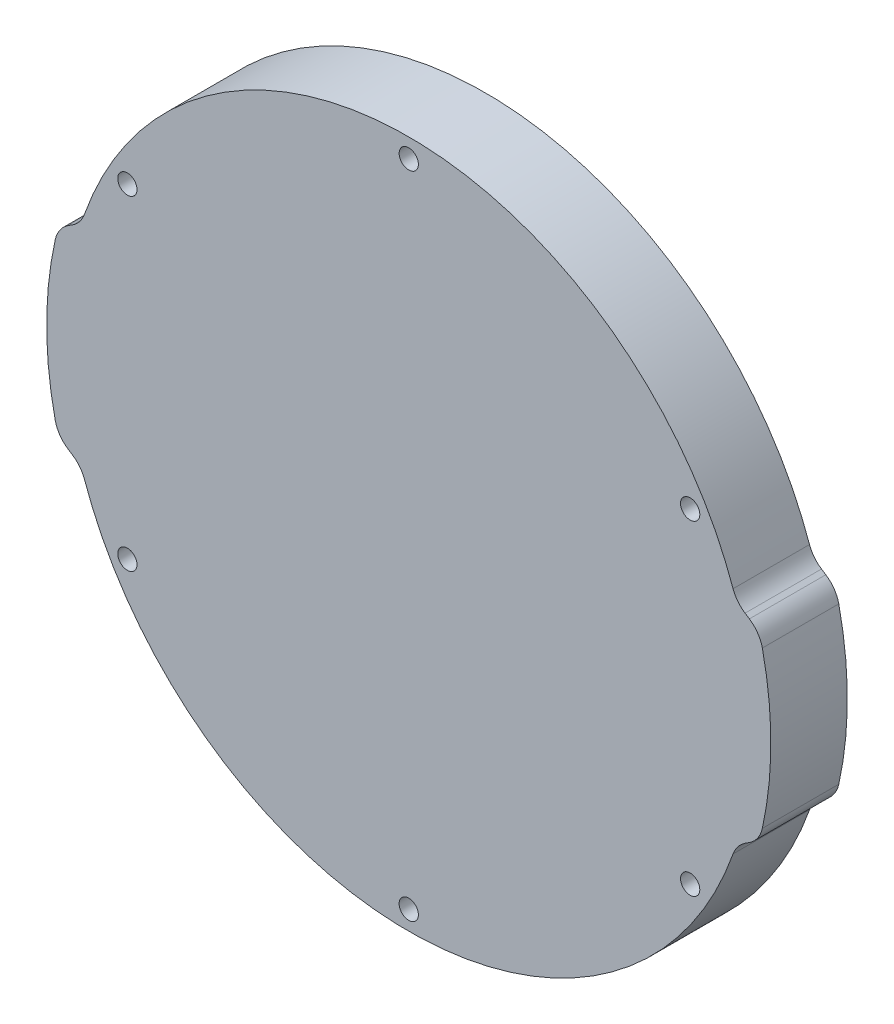
ISO-10303-21;
HEADER;
FILE_DESCRIPTION(('STEP AP214'),'2;1');
FILE_NAME('part.step','',(''),(''),'','','');
FILE_SCHEMA(('AUTOMOTIVE_DESIGN { 1 0 10303 214 1 1 1 1 }'));
ENDSEC;
DATA;
#1=APPLICATION_CONTEXT('core data for automotive mechanical design processes');
#2=APPLICATION_PROTOCOL_DEFINITION('international standard','automotive_design',2000,#1);
#3=PRODUCT_CONTEXT('',#1,'mechanical');
#4=PRODUCT('Part','Part','',(#3));
#5=PRODUCT_RELATED_PRODUCT_CATEGORY('part','',(#4));
#6=PRODUCT_DEFINITION_FORMATION('','',#4);
#7=PRODUCT_DEFINITION_CONTEXT('part definition',#1,'design');
#8=PRODUCT_DEFINITION('design','',#6,#7);
#9=PRODUCT_DEFINITION_SHAPE('','',#8);
#10=(LENGTH_UNIT() NAMED_UNIT(*) SI_UNIT(.MILLI.,.METRE.));
#11=(NAMED_UNIT(*) PLANE_ANGLE_UNIT() SI_UNIT($,.RADIAN.));
#12=(NAMED_UNIT(*) SI_UNIT($,.STERADIAN.) SOLID_ANGLE_UNIT());
#13=UNCERTAINTY_MEASURE_WITH_UNIT(LENGTH_MEASURE(1.E-05),#10,'distance_accuracy_value','');
#14=(GEOMETRIC_REPRESENTATION_CONTEXT(3) GLOBAL_UNCERTAINTY_ASSIGNED_CONTEXT((#13)) GLOBAL_UNIT_ASSIGNED_CONTEXT((#10,
#11,#12)) REPRESENTATION_CONTEXT('',''));
#15=CARTESIAN_POINT('',(0.,0.,0.));
#16=DIRECTION('',(0.,0.,1.));
#17=DIRECTION('',(1.,0.,0.));
#18=AXIS2_PLACEMENT_3D('',#15,#16,#17);
#19=CARTESIAN_POINT('',(0.,0.,12.7));
#20=DIRECTION('',(0.,0.,-1.));
#21=DIRECTION('',(-1.,0.,0.));
#22=AXIS2_PLACEMENT_3D('',#19,#20,#21);
#23=PLANE('',#22);
#24=CARTESIAN_POINT('',(5.42327943909187E-12,-53.975,12.7));
#25=DIRECTION('',(0.,0.,1.));
#26=DIRECTION('',(1.,0.,0.));
#27=AXIS2_PLACEMENT_3D('',#24,#25,#26);
#28=CIRCLE('',#27,1.6);
#29=CARTESIAN_POINT('',(1.60000000000542,-53.975,12.7));
#30=VERTEX_POINT('',#29);
#31=EDGE_CURVE('E509',#30,#30,#28,.T.);
#32=ORIENTED_EDGE('',*,*,#31,.F.);
#33=EDGE_LOOP('',(#32));
#34=FACE_BOUND('',#33,.T.);
#35=CARTESIAN_POINT('',(46.7437211692664,26.9875000000024,12.7));
#36=DIRECTION('',(0.,0.,1.));
#37=DIRECTION('',(1.,0.,0.));
#38=AXIS2_PLACEMENT_3D('',#35,#36,#37);
#39=CIRCLE('',#38,1.60000000000001);
#40=CARTESIAN_POINT('',(48.3437211692664,26.9875000000024,12.7));
#41=VERTEX_POINT('',#40);
#42=EDGE_CURVE('E318',#41,#41,#39,.T.);
#43=ORIENTED_EDGE('',*,*,#42,.F.);
#44=EDGE_LOOP('',(#43));
#45=FACE_BOUND('',#44,.T.);
#46=CARTESIAN_POINT('',(0.,53.975,12.7));
#47=DIRECTION('',(0.,0.,1.));
#48=DIRECTION('',(1.,0.,0.));
#49=AXIS2_PLACEMENT_3D('',#46,#47,#48);
#50=CIRCLE('',#49,1.6);
#51=CARTESIAN_POINT('',(1.6,53.975,12.7));
#52=VERTEX_POINT('',#51);
#53=EDGE_CURVE('E327',#52,#52,#50,.T.);
#54=ORIENTED_EDGE('',*,*,#53,.F.);
#55=EDGE_LOOP('',(#54));
#56=FACE_BOUND('',#55,.T.);
#57=CARTESIAN_POINT('',(0.,0.,12.7));
#58=DIRECTION('',(0.,0.,1.));
#59=DIRECTION('',(-1.,0.,0.));
#60=AXIS2_PLACEMENT_3D('',#57,#58,#59);
#61=CIRCLE('',#60,60.15);
#62=CARTESIAN_POINT('',(58.7341357738568,-12.97396604351,12.7));
#63=VERTEX_POINT('',#62);
#64=CARTESIAN_POINT('',(58.7341357738568,12.97396604351,12.7));
#65=VERTEX_POINT('',#64);
#66=EDGE_CURVE('E219',#63,#65,#61,.T.);
#67=ORIENTED_EDGE('',*,*,#66,.T.);
#68=CARTESIAN_POINT('',(53.8518302232453,11.8954983757203,12.7));
#69=DIRECTION('',(0.,0.,-1.));
#70=DIRECTION('',(-1.,0.,0.));
#71=AXIS2_PLACEMENT_3D('',#68,#69,#70);
#72=CIRCLE('',#71,5.);
#73=CARTESIAN_POINT('',(56.5773734681787,16.0873254260645,12.7));
#74=VERTEX_POINT('',#73);
#75=EDGE_CURVE('E256',#65,#74,#72,.F.);
#76=ORIENTED_EDGE('',*,*,#75,.T.);
#77=DIRECTION('',(-0.838365410068851,0.545108648986684,0.));
#78=VECTOR('',#77,1.);
#79=CARTESIAN_POINT('',(58.2496566513486,15.,12.7));
#80=LINE('',#79,#78);
#81=CARTESIAN_POINT('',(55.8597455361239,16.5539300686456,12.7));
#82=VERTEX_POINT('',#81);
#83=EDGE_CURVE('E354',#74,#82,#80,.T.);
#84=ORIENTED_EDGE('',*,*,#83,.T.);
#85=CARTESIAN_POINT('',(58.5852887810573,20.7457571189899,12.7));
#86=DIRECTION('',(0.,0.,-1.));
#87=DIRECTION('',(-1.,0.,0.));
#88=AXIS2_PLACEMENT_3D('',#85,#86,#87);
#89=CIRCLE('',#88,5.);
#90=CARTESIAN_POINT('',(53.87207166271,19.0767501102216,12.7));
#91=VERTEX_POINT('',#90);
#92=EDGE_CURVE('E171',#82,#91,#89,.T.);
#93=ORIENTED_EDGE('',*,*,#92,.T.);
#94=CARTESIAN_POINT('',(0.,0.,12.7));
#95=DIRECTION('',(0.,0.,1.));
#96=DIRECTION('',(1.,0.,0.));
#97=AXIS2_PLACEMENT_3D('',#94,#95,#96);
#98=CIRCLE('',#97,57.15);
#99=CARTESIAN_POINT('',(-53.87207166271,19.0767501102216,12.7));
#100=VERTEX_POINT('',#99);
#101=EDGE_CURVE('E181',#91,#100,#98,.T.);
#102=ORIENTED_EDGE('',*,*,#101,.T.);
#103=CARTESIAN_POINT('',(-58.5852887810573,20.7457571189899,12.7));
#104=DIRECTION('',(0.,0.,-1.));
#105=DIRECTION('',(-1.,0.,0.));
#106=AXIS2_PLACEMENT_3D('',#103,#104,#105);
#107=CIRCLE('',#106,5.);
#108=CARTESIAN_POINT('',(-55.8597455361239,16.5539300686456,12.7));
#109=VERTEX_POINT('',#108);
#110=EDGE_CURVE('E11',#100,#109,#107,.T.);
#111=ORIENTED_EDGE('',*,*,#110,.T.);
#112=DIRECTION('',(-0.838365410068851,-0.545108648986684,0.));
#113=VECTOR('',#112,1.);
#114=CARTESIAN_POINT('',(-58.2496566513486,15.,12.7));
#115=LINE('',#114,#113);
#116=CARTESIAN_POINT('',(-56.5773734681787,16.0873254260645,12.7));
#117=VERTEX_POINT('',#116);
#118=EDGE_CURVE('E308',#109,#117,#115,.T.);
#119=ORIENTED_EDGE('',*,*,#118,.T.);
#120=CARTESIAN_POINT('',(-53.8518302232453,11.8954983757203,12.7));
#121=DIRECTION('',(0.,0.,-1.));
#122=DIRECTION('',(-1.,0.,0.));
#123=AXIS2_PLACEMENT_3D('',#120,#121,#122);
#124=CIRCLE('',#123,5.);
#125=CARTESIAN_POINT('',(-58.7341357738568,12.97396604351,12.7));
#126=VERTEX_POINT('',#125);
#127=EDGE_CURVE('E247',#117,#126,#124,.F.);
#128=ORIENTED_EDGE('',*,*,#127,.T.);
#129=CARTESIAN_POINT('',(0.,0.,12.7));
#130=DIRECTION('',(0.,0.,1.));
#131=DIRECTION('',(1.,0.,0.));
#132=AXIS2_PLACEMENT_3D('',#129,#130,#131);
#133=CIRCLE('',#132,60.15);
#134=CARTESIAN_POINT('',(-58.7341357738568,-12.97396604351,12.7));
#135=VERTEX_POINT('',#134);
#136=EDGE_CURVE('E312',#126,#135,#133,.T.);
#137=ORIENTED_EDGE('',*,*,#136,.T.);
#138=CARTESIAN_POINT('',(-53.8518302232453,-11.8954983757203,12.7));
#139=DIRECTION('',(0.,0.,-1.));
#140=DIRECTION('',(-1.,0.,0.));
#141=AXIS2_PLACEMENT_3D('',#138,#139,#140);
#142=CIRCLE('',#141,5.);
#143=CARTESIAN_POINT('',(-56.5773734681787,-16.0873254260645,12.7));
#144=VERTEX_POINT('',#143);
#145=EDGE_CURVE('E250',#135,#144,#142,.F.);
#146=ORIENTED_EDGE('',*,*,#145,.T.);
#147=DIRECTION('',(0.838365410068851,-0.545108648986684,0.));
#148=VECTOR('',#147,1.);
#149=CARTESIAN_POINT('',(-58.2496566513486,-15.,12.7));
#150=LINE('',#149,#148);
#151=CARTESIAN_POINT('',(-55.8597455361239,-16.5539300686456,12.7));
#152=VERTEX_POINT('',#151);
#153=EDGE_CURVE('E363',#144,#152,#150,.T.);
#154=ORIENTED_EDGE('',*,*,#153,.T.);
#155=CARTESIAN_POINT('',(-58.5852887810573,-20.7457571189899,12.7));
#156=DIRECTION('',(0.,0.,-1.));
#157=DIRECTION('',(-1.,0.,0.));
#158=AXIS2_PLACEMENT_3D('',#155,#156,#157);
#159=CIRCLE('',#158,5.);
#160=CARTESIAN_POINT('',(-53.87207166271,-19.0767501102216,12.7));
#161=VERTEX_POINT('',#160);
#162=EDGE_CURVE('E301',#152,#161,#159,.T.);
#163=ORIENTED_EDGE('',*,*,#162,.T.);
#164=CARTESIAN_POINT('',(0.,0.,12.7));
#165=DIRECTION('',(0.,0.,1.));
#166=DIRECTION('',(1.,0.,0.));
#167=AXIS2_PLACEMENT_3D('',#164,#165,#166);
#168=CIRCLE('',#167,57.15);
#169=CARTESIAN_POINT('',(53.87207166271,-19.0767501102216,12.7));
#170=VERTEX_POINT('',#169);
#171=EDGE_CURVE('E367',#161,#170,#168,.T.);
#172=ORIENTED_EDGE('',*,*,#171,.T.);
#173=CARTESIAN_POINT('',(58.5852887810573,-20.7457571189899,12.7));
#174=DIRECTION('',(0.,0.,-1.));
#175=DIRECTION('',(-1.,0.,0.));
#176=AXIS2_PLACEMENT_3D('',#173,#174,#175);
#177=CIRCLE('',#176,5.);
#178=CARTESIAN_POINT('',(55.8597455361239,-16.5539300686456,12.7));
#179=VERTEX_POINT('',#178);
#180=EDGE_CURVE('E68',#170,#179,#177,.T.);
#181=ORIENTED_EDGE('',*,*,#180,.T.);
#182=DIRECTION('',(0.838365410068851,0.545108648986684,0.));
#183=VECTOR('',#182,1.);
#184=CARTESIAN_POINT('',(58.2496566513486,-15.,12.7));
#185=LINE('',#184,#183);
#186=CARTESIAN_POINT('',(56.5773734681787,-16.0873254260645,12.7));
#187=VERTEX_POINT('',#186);
#188=EDGE_CURVE('E221',#179,#187,#185,.T.);
#189=ORIENTED_EDGE('',*,*,#188,.T.);
#190=CARTESIAN_POINT('',(53.8518302232453,-11.8954983757203,12.7));
#191=DIRECTION('',(0.,0.,-1.));
#192=DIRECTION('',(-1.,0.,0.));
#193=AXIS2_PLACEMENT_3D('',#190,#191,#192);
#194=CIRCLE('',#193,5.);
#195=EDGE_CURVE('E253',#187,#63,#194,.F.);
#196=ORIENTED_EDGE('',*,*,#195,.T.);
#197=EDGE_LOOP('',(#67,#76,#84,#93,#102,#111,#119,#128,#137,#146,#154,#163,#172,#181,#189,#196));
#198=FACE_BOUND('',#197,.T.);
#199=CARTESIAN_POINT('',(-46.743721169261,-26.9875000000024,12.7));
#200=DIRECTION('',(0.,0.,1.));
#201=DIRECTION('',(1.,0.,0.));
#202=AXIS2_PLACEMENT_3D('',#199,#200,#201);
#203=CIRCLE('',#202,1.6);
#204=CARTESIAN_POINT('',(-45.143721169261,-26.9875000000024,12.7));
#205=VERTEX_POINT('',#204);
#206=EDGE_CURVE('E317',#205,#205,#203,.T.);
#207=ORIENTED_EDGE('',*,*,#206,.F.);
#208=EDGE_LOOP('',(#207));
#209=FACE_BOUND('',#208,.T.);
#210=CARTESIAN_POINT('',(46.7437211692692,-26.9874999999976,12.7));
#211=DIRECTION('',(0.,0.,1.));
#212=DIRECTION('',(1.,0.,0.));
#213=AXIS2_PLACEMENT_3D('',#210,#211,#212);
#214=CIRCLE('',#213,1.6);
#215=CARTESIAN_POINT('',(48.3437211692691,-26.9874999999976,12.7));
#216=VERTEX_POINT('',#215);
#217=EDGE_CURVE('E332',#216,#216,#214,.T.);
#218=ORIENTED_EDGE('',*,*,#217,.F.);
#219=EDGE_LOOP('',(#218));
#220=FACE_BOUND('',#219,.T.);
#221=CARTESIAN_POINT('',(-46.7437211692637,26.9874999999976,12.7));
#222=DIRECTION('',(0.,0.,1.));
#223=DIRECTION('',(1.,0.,0.));
#224=AXIS2_PLACEMENT_3D('',#221,#222,#223);
#225=CIRCLE('',#224,1.6);
#226=CARTESIAN_POINT('',(-45.1437211692637,26.9874999999976,12.7));
#227=VERTEX_POINT('',#226);
#228=EDGE_CURVE('E502',#227,#227,#225,.T.);
#229=ORIENTED_EDGE('',*,*,#228,.F.);
#230=EDGE_LOOP('',(#229));
#231=FACE_BOUND('',#230,.T.);
#232=ADVANCED_FACE('F45',(#34,#45,#56,#198,#209,#220,#231),#23,.F.);
#233=CARTESIAN_POINT('',(0.,0.,0.));
#234=DIRECTION('',(0.,0.,-1.));
#235=DIRECTION('',(-1.,0.,0.));
#236=AXIS2_PLACEMENT_3D('',#233,#234,#235);
#237=PLANE('',#236);
#238=CARTESIAN_POINT('',(5.42327943909187E-12,-53.975,0.));
#239=DIRECTION('',(0.,0.,1.));
#240=DIRECTION('',(1.,0.,0.));
#241=AXIS2_PLACEMENT_3D('',#238,#239,#240);
#242=CIRCLE('',#241,1.6);
#243=CARTESIAN_POINT('',(1.60000000000542,-53.975,0.));
#244=VERTEX_POINT('',#243);
#245=EDGE_CURVE('E506',#244,#244,#242,.T.);
#246=ORIENTED_EDGE('',*,*,#245,.T.);
#247=EDGE_LOOP('',(#246));
#248=FACE_BOUND('',#247,.T.);
#249=CARTESIAN_POINT('',(46.7437211692664,26.9875000000024,0.));
#250=DIRECTION('',(0.,0.,1.));
#251=DIRECTION('',(1.,0.,0.));
#252=AXIS2_PLACEMENT_3D('',#249,#250,#251);
#253=CIRCLE('',#252,1.60000000000001);
#254=CARTESIAN_POINT('',(48.3437211692664,26.9875000000024,0.));
#255=VERTEX_POINT('',#254);
#256=EDGE_CURVE('E329',#255,#255,#253,.T.);
#257=ORIENTED_EDGE('',*,*,#256,.T.);
#258=EDGE_LOOP('',(#257));
#259=FACE_BOUND('',#258,.T.);
#260=CARTESIAN_POINT('',(0.,53.975,0.));
#261=DIRECTION('',(0.,0.,1.));
#262=DIRECTION('',(1.,0.,0.));
#263=AXIS2_PLACEMENT_3D('',#260,#261,#262);
#264=CIRCLE('',#263,1.6);
#265=CARTESIAN_POINT('',(1.6,53.975,0.));
#266=VERTEX_POINT('',#265);
#267=EDGE_CURVE('E323',#266,#266,#264,.T.);
#268=ORIENTED_EDGE('',*,*,#267,.T.);
#269=EDGE_LOOP('',(#268));
#270=FACE_BOUND('',#269,.T.);
#271=DIRECTION('',(-0.838365410068851,0.545108648986684,0.));
#272=VECTOR('',#271,1.);
#273=CARTESIAN_POINT('',(58.2496566513486,15.,0.));
#274=LINE('',#273,#272);
#275=CARTESIAN_POINT('',(56.5773734681787,16.0873254260645,0.));
#276=VERTEX_POINT('',#275);
#277=CARTESIAN_POINT('',(55.8597455361239,16.5539300686456,0.));
#278=VERTEX_POINT('',#277);
#279=EDGE_CURVE('E191',#276,#278,#274,.T.);
#280=ORIENTED_EDGE('',*,*,#279,.F.);
#281=CARTESIAN_POINT('',(53.8518302232453,11.8954983757203,0.));
#282=DIRECTION('',(0.,0.,-1.));
#283=DIRECTION('',(-1.,0.,0.));
#284=AXIS2_PLACEMENT_3D('',#281,#282,#283);
#285=CIRCLE('',#284,5.);
#286=CARTESIAN_POINT('',(58.7341357738568,12.97396604351,0.));
#287=VERTEX_POINT('',#286);
#288=EDGE_CURVE('E237',#276,#287,#285,.T.);
#289=ORIENTED_EDGE('',*,*,#288,.T.);
#290=CARTESIAN_POINT('',(0.,0.,0.));
#291=DIRECTION('',(0.,0.,1.));
#292=DIRECTION('',(-1.,0.,0.));
#293=AXIS2_PLACEMENT_3D('',#290,#291,#292);
#294=CIRCLE('',#293,60.15);
#295=CARTESIAN_POINT('',(58.7341357738568,-12.97396604351,0.));
#296=VERTEX_POINT('',#295);
#297=EDGE_CURVE('E201',#296,#287,#294,.T.);
#298=ORIENTED_EDGE('',*,*,#297,.F.);
#299=CARTESIAN_POINT('',(53.8518302232453,-11.8954983757203,0.));
#300=DIRECTION('',(0.,0.,-1.));
#301=DIRECTION('',(-1.,0.,0.));
#302=AXIS2_PLACEMENT_3D('',#299,#300,#301);
#303=CIRCLE('',#302,5.);
#304=CARTESIAN_POINT('',(56.5773734681787,-16.0873254260645,0.));
#305=VERTEX_POINT('',#304);
#306=EDGE_CURVE('E234',#296,#305,#303,.T.);
#307=ORIENTED_EDGE('',*,*,#306,.T.);
#308=DIRECTION('',(0.838365410068851,0.545108648986684,0.));
#309=VECTOR('',#308,1.);
#310=CARTESIAN_POINT('',(58.2496566513486,-15.,0.));
#311=LINE('',#310,#309);
#312=CARTESIAN_POINT('',(55.8597455361239,-16.5539300686456,0.));
#313=VERTEX_POINT('',#312);
#314=EDGE_CURVE('E216',#313,#305,#311,.T.);
#315=ORIENTED_EDGE('',*,*,#314,.F.);
#316=CARTESIAN_POINT('',(58.5852887810573,-20.7457571189899,0.));
#317=DIRECTION('',(0.,0.,-1.));
#318=DIRECTION('',(-1.,0.,0.));
#319=AXIS2_PLACEMENT_3D('',#316,#317,#318);
#320=CIRCLE('',#319,5.);
#321=CARTESIAN_POINT('',(53.87207166271,-19.0767501102216,0.));
#322=VERTEX_POINT('',#321);
#323=EDGE_CURVE('E293',#313,#322,#320,.F.);
#324=ORIENTED_EDGE('',*,*,#323,.T.);
#325=CARTESIAN_POINT('',(0.,0.,0.));
#326=DIRECTION('',(0.,0.,1.));
#327=DIRECTION('',(1.,0.,0.));
#328=AXIS2_PLACEMENT_3D('',#325,#326,#327);
#329=CIRCLE('',#328,57.15);
#330=CARTESIAN_POINT('',(-53.87207166271,-19.0767501102216,0.));
#331=VERTEX_POINT('',#330);
#332=EDGE_CURVE('E212',#331,#322,#329,.T.);
#333=ORIENTED_EDGE('',*,*,#332,.F.);
#334=CARTESIAN_POINT('',(-58.5852887810573,-20.7457571189899,0.));
#335=DIRECTION('',(0.,0.,-1.));
#336=DIRECTION('',(-1.,0.,0.));
#337=AXIS2_PLACEMENT_3D('',#334,#335,#336);
#338=CIRCLE('',#337,5.);
#339=CARTESIAN_POINT('',(-55.8597455361239,-16.5539300686456,0.));
#340=VERTEX_POINT('',#339);
#341=EDGE_CURVE('E298',#331,#340,#338,.F.);
#342=ORIENTED_EDGE('',*,*,#341,.T.);
#343=DIRECTION('',(0.838365410068851,-0.545108648986684,0.));
#344=VECTOR('',#343,1.);
#345=CARTESIAN_POINT('',(-58.2496566513486,-15.,0.));
#346=LINE('',#345,#344);
#347=CARTESIAN_POINT('',(-56.5773734681787,-16.0873254260645,0.));
#348=VERTEX_POINT('',#347);
#349=EDGE_CURVE('E208',#348,#340,#346,.T.);
#350=ORIENTED_EDGE('',*,*,#349,.F.);
#351=CARTESIAN_POINT('',(-53.8518302232453,-11.8954983757203,0.));
#352=DIRECTION('',(0.,0.,-1.));
#353=DIRECTION('',(-1.,0.,0.));
#354=AXIS2_PLACEMENT_3D('',#351,#352,#353);
#355=CIRCLE('',#354,5.);
#356=CARTESIAN_POINT('',(-58.7341357738568,-12.97396604351,0.));
#357=VERTEX_POINT('',#356);
#358=EDGE_CURVE('E231',#348,#357,#355,.T.);
#359=ORIENTED_EDGE('',*,*,#358,.T.);
#360=CARTESIAN_POINT('',(0.,0.,0.));
#361=DIRECTION('',(0.,0.,1.));
#362=DIRECTION('',(1.,0.,0.));
#363=AXIS2_PLACEMENT_3D('',#360,#361,#362);
#364=CIRCLE('',#363,60.15);
#365=CARTESIAN_POINT('',(-58.7341357738568,12.97396604351,0.));
#366=VERTEX_POINT('',#365);
#367=EDGE_CURVE('E198',#366,#357,#364,.T.);
#368=ORIENTED_EDGE('',*,*,#367,.F.);
#369=CARTESIAN_POINT('',(-53.8518302232453,11.8954983757203,0.));
#370=DIRECTION('',(0.,0.,-1.));
#371=DIRECTION('',(-1.,0.,0.));
#372=AXIS2_PLACEMENT_3D('',#369,#370,#371);
#373=CIRCLE('',#372,5.);
#374=CARTESIAN_POINT('',(-56.5773734681787,16.0873254260645,0.));
#375=VERTEX_POINT('',#374);
#376=EDGE_CURVE('E228',#366,#375,#373,.T.);
#377=ORIENTED_EDGE('',*,*,#376,.T.);
#378=DIRECTION('',(-0.838365410068851,-0.545108648986684,0.));
#379=VECTOR('',#378,1.);
#380=CARTESIAN_POINT('',(-58.2496566513486,15.,0.));
#381=LINE('',#380,#379);
#382=CARTESIAN_POINT('',(-55.8597455361239,16.5539300686456,0.));
#383=VERTEX_POINT('',#382);
#384=EDGE_CURVE('E190',#383,#375,#381,.T.);
#385=ORIENTED_EDGE('',*,*,#384,.F.);
#386=CARTESIAN_POINT('',(-58.5852887810573,20.7457571189899,0.));
#387=DIRECTION('',(0.,0.,-1.));
#388=DIRECTION('',(-1.,0.,0.));
#389=AXIS2_PLACEMENT_3D('',#386,#387,#388);
#390=CIRCLE('',#389,5.);
#391=CARTESIAN_POINT('',(-53.87207166271,19.0767501102216,0.));
#392=VERTEX_POINT('',#391);
#393=EDGE_CURVE('E54',#383,#392,#390,.F.);
#394=ORIENTED_EDGE('',*,*,#393,.T.);
#395=CARTESIAN_POINT('',(0.,0.,0.));
#396=DIRECTION('',(0.,0.,1.));
#397=DIRECTION('',(1.,0.,0.));
#398=AXIS2_PLACEMENT_3D('',#395,#396,#397);
#399=CIRCLE('',#398,57.15);
#400=CARTESIAN_POINT('',(53.87207166271,19.0767501102216,0.));
#401=VERTEX_POINT('',#400);
#402=EDGE_CURVE('E178',#401,#392,#399,.T.);
#403=ORIENTED_EDGE('',*,*,#402,.F.);
#404=CARTESIAN_POINT('',(58.5852887810573,20.7457571189899,0.));
#405=DIRECTION('',(0.,0.,-1.));
#406=DIRECTION('',(-1.,0.,0.));
#407=AXIS2_PLACEMENT_3D('',#404,#405,#406);
#408=CIRCLE('',#407,5.);
#409=EDGE_CURVE('E160',#401,#278,#408,.F.);
#410=ORIENTED_EDGE('',*,*,#409,.T.);
#411=EDGE_LOOP('',(#280,#289,#298,#307,#315,#324,#333,#342,#350,#359,#368,#377,#385,#394,#403,#410));
#412=FACE_BOUND('',#411,.T.);
#413=CARTESIAN_POINT('',(-46.743721169261,-26.9875000000024,0.));
#414=DIRECTION('',(0.,0.,1.));
#415=DIRECTION('',(1.,0.,0.));
#416=AXIS2_PLACEMENT_3D('',#413,#414,#415);
#417=CIRCLE('',#416,1.6);
#418=CARTESIAN_POINT('',(-45.143721169261,-26.9875000000024,0.));
#419=VERTEX_POINT('',#418);
#420=EDGE_CURVE('E314',#419,#419,#417,.T.);
#421=ORIENTED_EDGE('',*,*,#420,.T.);
#422=EDGE_LOOP('',(#421));
#423=FACE_BOUND('',#422,.T.);
#424=CARTESIAN_POINT('',(46.7437211692692,-26.9874999999976,0.));
#425=DIRECTION('',(0.,0.,1.));
#426=DIRECTION('',(1.,0.,0.));
#427=AXIS2_PLACEMENT_3D('',#424,#425,#426);
#428=CIRCLE('',#427,1.6);
#429=CARTESIAN_POINT('',(48.3437211692691,-26.9874999999976,0.));
#430=VERTEX_POINT('',#429);
#431=EDGE_CURVE('E341',#430,#430,#428,.T.);
#432=ORIENTED_EDGE('',*,*,#431,.T.);
#433=EDGE_LOOP('',(#432));
#434=FACE_BOUND('',#433,.T.);
#435=CARTESIAN_POINT('',(-46.7437211692637,26.9874999999976,0.));
#436=DIRECTION('',(0.,0.,1.));
#437=DIRECTION('',(1.,0.,0.));
#438=AXIS2_PLACEMENT_3D('',#435,#436,#437);
#439=CIRCLE('',#438,1.6);
#440=CARTESIAN_POINT('',(-45.1437211692637,26.9874999999976,0.));
#441=VERTEX_POINT('',#440);
#442=EDGE_CURVE('E500',#441,#441,#439,.T.);
#443=ORIENTED_EDGE('',*,*,#442,.T.);
#444=EDGE_LOOP('',(#443));
#445=FACE_BOUND('',#444,.T.);
#446=ADVANCED_FACE('F186',(#248,#259,#270,#412,#423,#434,#445),#237,.T.);
#447=CARTESIAN_POINT('',(0.,0.,12.7));
#448=DIRECTION('',(0.,0.,-1.));
#449=DIRECTION('',(-1.,0.,0.));
#450=AXIS2_PLACEMENT_3D('',#447,#448,#449);
#451=CYLINDRICAL_SURFACE('',#450,60.15);
#452=ORIENTED_EDGE('',*,*,#297,.T.);
#453=DIRECTION('',(0.,0.,-1.));
#454=VECTOR('',#453,1.);
#455=CARTESIAN_POINT('',(58.7341357738569,12.97396604351,12.7));
#456=LINE('',#455,#454);
#457=EDGE_CURVE('E244',#287,#65,#456,.F.);
#458=ORIENTED_EDGE('',*,*,#457,.T.);
#459=ORIENTED_EDGE('',*,*,#66,.F.);
#460=DIRECTION('',(0.,0.,-1.));
#461=VECTOR('',#460,1.);
#462=CARTESIAN_POINT('',(58.7341357738569,-12.97396604351,12.7));
#463=LINE('',#462,#461);
#464=EDGE_CURVE('E240',#63,#296,#463,.T.);
#465=ORIENTED_EDGE('',*,*,#464,.T.);
#466=EDGE_LOOP('',(#452,#458,#459,#465));
#467=FACE_BOUND('',#466,.T.);
#468=ADVANCED_FACE('F377',(#467),#451,.T.);
#469=CARTESIAN_POINT('',(58.2496566513486,15.,12.7));
#470=DIRECTION('',(-0.545108648986684,-0.838365410068851,0.));
#471=DIRECTION('',(0.838365410068851,-0.545108648986684,0.));
#472=AXIS2_PLACEMENT_3D('',#469,#470,#471);
#473=PLANE('',#472);
#474=ORIENTED_EDGE('',*,*,#279,.T.);
#475=DIRECTION('',(0.,0.,1.));
#476=VECTOR('',#475,1.);
#477=CARTESIAN_POINT('',(55.8597455361239,16.5539300686456,12.7));
#478=LINE('',#477,#476);
#479=EDGE_CURVE('E165',#278,#82,#478,.T.);
#480=ORIENTED_EDGE('',*,*,#479,.T.);
#481=ORIENTED_EDGE('',*,*,#83,.F.);
#482=DIRECTION('',(0.,0.,-1.));
#483=VECTOR('',#482,1.);
#484=CARTESIAN_POINT('',(56.5773734681787,16.0873254260645,12.7));
#485=LINE('',#484,#483);
#486=EDGE_CURVE('E183',#74,#276,#485,.T.);
#487=ORIENTED_EDGE('',*,*,#486,.T.);
#488=EDGE_LOOP('',(#474,#480,#481,#487));
#489=FACE_BOUND('',#488,.T.);
#490=ADVANCED_FACE('F387',(#489),#473,.F.);
#491=CARTESIAN_POINT('',(0.,0.,12.7));
#492=DIRECTION('',(0.,0.,-1.));
#493=DIRECTION('',(-1.,0.,0.));
#494=AXIS2_PLACEMENT_3D('',#491,#492,#493);
#495=CYLINDRICAL_SURFACE('',#494,57.15);
#496=ORIENTED_EDGE('',*,*,#101,.F.);
#497=DIRECTION('',(0.,0.,-1.));
#498=VECTOR('',#497,1.);
#499=CARTESIAN_POINT('',(53.87207166271,19.0767501102216,12.7));
#500=LINE('',#499,#498);
#501=EDGE_CURVE('E164',#91,#401,#500,.T.);
#502=ORIENTED_EDGE('',*,*,#501,.T.);
#503=ORIENTED_EDGE('',*,*,#402,.T.);
#504=DIRECTION('',(0.,0.,-1.));
#505=VECTOR('',#504,1.);
#506=CARTESIAN_POINT('',(-53.87207166271,19.0767501102216,12.7));
#507=LINE('',#506,#505);
#508=EDGE_CURVE('E184',#392,#100,#507,.F.);
#509=ORIENTED_EDGE('',*,*,#508,.T.);
#510=EDGE_LOOP('',(#496,#502,#503,#509));
#511=FACE_BOUND('',#510,.T.);
#512=ADVANCED_FACE('F177',(#511),#495,.T.);
#513=CARTESIAN_POINT('',(-58.2496566513486,15.,12.7));
#514=DIRECTION('',(0.545108648986684,-0.838365410068851,0.));
#515=DIRECTION('',(0.838365410068851,0.545108648986684,0.));
#516=AXIS2_PLACEMENT_3D('',#513,#514,#515);
#517=PLANE('',#516);
#518=ORIENTED_EDGE('',*,*,#118,.F.);
#519=DIRECTION('',(0.,0.,1.));
#520=VECTOR('',#519,1.);
#521=CARTESIAN_POINT('',(-55.8597455361239,16.5539300686456,0.));
#522=LINE('',#521,#520);
#523=EDGE_CURVE('E172',#109,#383,#522,.F.);
#524=ORIENTED_EDGE('',*,*,#523,.T.);
#525=ORIENTED_EDGE('',*,*,#384,.T.);
#526=DIRECTION('',(0.,0.,-1.));
#527=VECTOR('',#526,1.);
#528=CARTESIAN_POINT('',(-56.5773734681787,16.0873254260645,12.7));
#529=LINE('',#528,#527);
#530=EDGE_CURVE('E286',#375,#117,#529,.F.);
#531=ORIENTED_EDGE('',*,*,#530,.T.);
#532=EDGE_LOOP('',(#518,#524,#525,#531));
#533=FACE_BOUND('',#532,.T.);
#534=ADVANCED_FACE('F394',(#533),#517,.F.);
#535=CARTESIAN_POINT('',(0.,0.,12.7));
#536=DIRECTION('',(0.,0.,-1.));
#537=DIRECTION('',(-1.,0.,0.));
#538=AXIS2_PLACEMENT_3D('',#535,#536,#537);
#539=CYLINDRICAL_SURFACE('',#538,60.15);
#540=ORIENTED_EDGE('',*,*,#367,.T.);
#541=DIRECTION('',(0.,0.,-1.));
#542=VECTOR('',#541,1.);
#543=CARTESIAN_POINT('',(-58.7341357738569,-12.97396604351,12.7));
#544=LINE('',#543,#542);
#545=EDGE_CURVE('E283',#357,#135,#544,.F.);
#546=ORIENTED_EDGE('',*,*,#545,.T.);
#547=ORIENTED_EDGE('',*,*,#136,.F.);
#548=DIRECTION('',(0.,0.,-1.));
#549=VECTOR('',#548,1.);
#550=CARTESIAN_POINT('',(-58.7341357738569,12.97396604351,12.7));
#551=LINE('',#550,#549);
#552=EDGE_CURVE('E279',#126,#366,#551,.T.);
#553=ORIENTED_EDGE('',*,*,#552,.T.);
#554=EDGE_LOOP('',(#540,#546,#547,#553));
#555=FACE_BOUND('',#554,.T.);
#556=ADVANCED_FACE('F421',(#555),#539,.T.);
#557=CARTESIAN_POINT('',(-58.2496566513486,-15.,12.7));
#558=DIRECTION('',(0.545108648986684,0.838365410068851,0.));
#559=DIRECTION('',(-0.838365410068851,0.545108648986684,0.));
#560=AXIS2_PLACEMENT_3D('',#557,#558,#559);
#561=PLANE('',#560);
#562=ORIENTED_EDGE('',*,*,#349,.T.);
#563=DIRECTION('',(0.,0.,1.));
#564=VECTOR('',#563,1.);
#565=CARTESIAN_POINT('',(-55.8597455361239,-16.5539300686456,12.7));
#566=LINE('',#565,#564);
#567=EDGE_CURVE('E276',#340,#152,#566,.T.);
#568=ORIENTED_EDGE('',*,*,#567,.T.);
#569=ORIENTED_EDGE('',*,*,#153,.F.);
#570=DIRECTION('',(0.,0.,-1.));
#571=VECTOR('',#570,1.);
#572=CARTESIAN_POINT('',(-56.5773734681787,-16.0873254260645,12.7));
#573=LINE('',#572,#571);
#574=EDGE_CURVE('E272',#144,#348,#573,.T.);
#575=ORIENTED_EDGE('',*,*,#574,.T.);
#576=EDGE_LOOP('',(#562,#568,#569,#575));
#577=FACE_BOUND('',#576,.T.);
#578=ADVANCED_FACE('F417',(#577),#561,.F.);
#579=CARTESIAN_POINT('',(0.,0.,12.7));
#580=DIRECTION('',(0.,0.,-1.));
#581=DIRECTION('',(-1.,0.,0.));
#582=AXIS2_PLACEMENT_3D('',#579,#580,#581);
#583=CYLINDRICAL_SURFACE('',#582,57.15);
#584=ORIENTED_EDGE('',*,*,#332,.T.);
#585=DIRECTION('',(0.,0.,-1.));
#586=VECTOR('',#585,1.);
#587=CARTESIAN_POINT('',(53.87207166271,-19.0767501102216,12.7));
#588=LINE('',#587,#586);
#589=EDGE_CURVE('E269',#322,#170,#588,.F.);
#590=ORIENTED_EDGE('',*,*,#589,.T.);
#591=ORIENTED_EDGE('',*,*,#171,.F.);
#592=DIRECTION('',(0.,0.,-1.));
#593=VECTOR('',#592,1.);
#594=CARTESIAN_POINT('',(-53.87207166271,-19.0767501102216,12.7));
#595=LINE('',#594,#593);
#596=EDGE_CURVE('E265',#161,#331,#595,.T.);
#597=ORIENTED_EDGE('',*,*,#596,.T.);
#598=EDGE_LOOP('',(#584,#590,#591,#597));
#599=FACE_BOUND('',#598,.T.);
#600=ADVANCED_FACE('F414',(#599),#583,.T.);
#601=CARTESIAN_POINT('',(58.2496566513486,-15.,12.7));
#602=DIRECTION('',(-0.545108648986684,0.838365410068851,0.));
#603=DIRECTION('',(-0.838365410068851,-0.545108648986684,0.));
#604=AXIS2_PLACEMENT_3D('',#601,#602,#603);
#605=PLANE('',#604);
#606=ORIENTED_EDGE('',*,*,#314,.T.);
#607=DIRECTION('',(0.,0.,-1.));
#608=VECTOR('',#607,1.);
#609=CARTESIAN_POINT('',(56.5773734681787,-16.0873254260645,12.7));
#610=LINE('',#609,#608);
#611=EDGE_CURVE('E61',#305,#187,#610,.F.);
#612=ORIENTED_EDGE('',*,*,#611,.T.);
#613=ORIENTED_EDGE('',*,*,#188,.F.);
#614=DIRECTION('',(0.,0.,1.));
#615=VECTOR('',#614,1.);
#616=CARTESIAN_POINT('',(55.8597455361239,-16.5539300686456,0.));
#617=LINE('',#616,#615);
#618=EDGE_CURVE('E259',#179,#313,#617,.F.);
#619=ORIENTED_EDGE('',*,*,#618,.T.);
#620=EDGE_LOOP('',(#606,#612,#613,#619));
#621=FACE_BOUND('',#620,.T.);
#622=ADVANCED_FACE('F411',(#621),#605,.F.);
#623=CARTESIAN_POINT('',(0.,53.975,12.7));
#624=DIRECTION('',(0.,0.,-1.));
#625=DIRECTION('',(-1.,0.,0.));
#626=AXIS2_PLACEMENT_3D('',#623,#624,#625);
#627=CYLINDRICAL_SURFACE('',#626,1.6);
#628=ORIENTED_EDGE('',*,*,#53,.T.);
#629=EDGE_LOOP('',(#628));
#630=FACE_BOUND('',#629,.T.);
#631=ORIENTED_EDGE('',*,*,#267,.F.);
#632=EDGE_LOOP('',(#631));
#633=FACE_BOUND('',#632,.T.);
#634=ADVANCED_FACE('F408',(#630,#633),#627,.F.);
#635=CARTESIAN_POINT('',(-46.743721169261,-26.9875000000024,12.7));
#636=DIRECTION('',(0.,0.,-1.));
#637=DIRECTION('',(-1.,0.,0.));
#638=AXIS2_PLACEMENT_3D('',#635,#636,#637);
#639=CYLINDRICAL_SURFACE('',#638,1.6);
#640=ORIENTED_EDGE('',*,*,#206,.T.);
#641=EDGE_LOOP('',(#640));
#642=FACE_BOUND('',#641,.T.);
#643=ORIENTED_EDGE('',*,*,#420,.F.);
#644=EDGE_LOOP('',(#643));
#645=FACE_BOUND('',#644,.T.);
#646=ADVANCED_FACE('F483',(#642,#645),#639,.F.);
#647=CARTESIAN_POINT('',(46.7437211692664,26.9875000000024,12.7));
#648=DIRECTION('',(0.,0.,-1.));
#649=DIRECTION('',(-1.,0.,0.));
#650=AXIS2_PLACEMENT_3D('',#647,#648,#649);
#651=CYLINDRICAL_SURFACE('',#650,1.60000000000001);
#652=ORIENTED_EDGE('',*,*,#42,.T.);
#653=EDGE_LOOP('',(#652));
#654=FACE_BOUND('',#653,.T.);
#655=ORIENTED_EDGE('',*,*,#256,.F.);
#656=EDGE_LOOP('',(#655));
#657=FACE_BOUND('',#656,.T.);
#658=ADVANCED_FACE('F480',(#654,#657),#651,.F.);
#659=CARTESIAN_POINT('',(46.7437211692692,-26.9874999999976,12.7));
#660=DIRECTION('',(0.,0.,-1.));
#661=DIRECTION('',(-1.,0.,0.));
#662=AXIS2_PLACEMENT_3D('',#659,#660,#661);
#663=CYLINDRICAL_SURFACE('',#662,1.6);
#664=ORIENTED_EDGE('',*,*,#217,.T.);
#665=EDGE_LOOP('',(#664));
#666=FACE_BOUND('',#665,.T.);
#667=ORIENTED_EDGE('',*,*,#431,.F.);
#668=EDGE_LOOP('',(#667));
#669=FACE_BOUND('',#668,.T.);
#670=ADVANCED_FACE('F472',(#666,#669),#663,.F.);
#671=CARTESIAN_POINT('',(5.42327943909187E-12,-53.975,12.7));
#672=DIRECTION('',(0.,0.,-1.));
#673=DIRECTION('',(-1.,0.,0.));
#674=AXIS2_PLACEMENT_3D('',#671,#672,#673);
#675=CYLINDRICAL_SURFACE('',#674,1.6);
#676=ORIENTED_EDGE('',*,*,#31,.T.);
#677=EDGE_LOOP('',(#676));
#678=FACE_BOUND('',#677,.T.);
#679=ORIENTED_EDGE('',*,*,#245,.F.);
#680=EDGE_LOOP('',(#679));
#681=FACE_BOUND('',#680,.T.);
#682=ADVANCED_FACE('F466',(#678,#681),#675,.F.);
#683=CARTESIAN_POINT('',(-46.7437211692637,26.9874999999976,12.7));
#684=DIRECTION('',(0.,0.,-1.));
#685=DIRECTION('',(-1.,0.,0.));
#686=AXIS2_PLACEMENT_3D('',#683,#684,#685);
#687=CYLINDRICAL_SURFACE('',#686,1.6);
#688=ORIENTED_EDGE('',*,*,#228,.T.);
#689=EDGE_LOOP('',(#688));
#690=FACE_BOUND('',#689,.T.);
#691=ORIENTED_EDGE('',*,*,#442,.F.);
#692=EDGE_LOOP('',(#691));
#693=FACE_BOUND('',#692,.T.);
#694=ADVANCED_FACE('F462',(#690,#693),#687,.F.);
#695=CARTESIAN_POINT('',(58.5852887810573,20.7457571189899,12.7));
#696=DIRECTION('',(0.,0.,-1.));
#697=DIRECTION('',(-1.,0.,0.));
#698=AXIS2_PLACEMENT_3D('',#695,#696,#697);
#699=CYLINDRICAL_SURFACE('',#698,5.);
#700=ORIENTED_EDGE('',*,*,#92,.F.);
#701=ORIENTED_EDGE('',*,*,#479,.F.);
#702=ORIENTED_EDGE('',*,*,#409,.F.);
#703=ORIENTED_EDGE('',*,*,#501,.F.);
#704=EDGE_LOOP('',(#700,#701,#702,#703));
#705=FACE_BOUND('',#704,.T.);
#706=ADVANCED_FACE('F163',(#705),#699,.F.);
#707=CARTESIAN_POINT('',(53.8518302232453,11.8954983757203,12.7));
#708=DIRECTION('',(0.,0.,-1.));
#709=DIRECTION('',(-1.,0.,0.));
#710=AXIS2_PLACEMENT_3D('',#707,#708,#709);
#711=CYLINDRICAL_SURFACE('',#710,5.);
#712=ORIENTED_EDGE('',*,*,#75,.F.);
#713=ORIENTED_EDGE('',*,*,#457,.F.);
#714=ORIENTED_EDGE('',*,*,#288,.F.);
#715=ORIENTED_EDGE('',*,*,#486,.F.);
#716=EDGE_LOOP('',(#712,#713,#714,#715));
#717=FACE_BOUND('',#716,.T.);
#718=ADVANCED_FACE('F382',(#717),#711,.T.);
#719=CARTESIAN_POINT('',(53.8518302232453,-11.8954983757203,12.7));
#720=DIRECTION('',(0.,0.,-1.));
#721=DIRECTION('',(-1.,0.,0.));
#722=AXIS2_PLACEMENT_3D('',#719,#720,#721);
#723=CYLINDRICAL_SURFACE('',#722,5.);
#724=ORIENTED_EDGE('',*,*,#195,.F.);
#725=ORIENTED_EDGE('',*,*,#611,.F.);
#726=ORIENTED_EDGE('',*,*,#306,.F.);
#727=ORIENTED_EDGE('',*,*,#464,.F.);
#728=EDGE_LOOP('',(#724,#725,#726,#727));
#729=FACE_BOUND('',#728,.T.);
#730=ADVANCED_FACE('F454',(#729),#723,.T.);
#731=CARTESIAN_POINT('',(58.5852887810573,-20.7457571189899,12.7));
#732=DIRECTION('',(0.,0.,-1.));
#733=DIRECTION('',(-1.,0.,0.));
#734=AXIS2_PLACEMENT_3D('',#731,#732,#733);
#735=CYLINDRICAL_SURFACE('',#734,5.);
#736=ORIENTED_EDGE('',*,*,#180,.F.);
#737=ORIENTED_EDGE('',*,*,#589,.F.);
#738=ORIENTED_EDGE('',*,*,#323,.F.);
#739=ORIENTED_EDGE('',*,*,#618,.F.);
#740=EDGE_LOOP('',(#736,#737,#738,#739));
#741=FACE_BOUND('',#740,.T.);
#742=ADVANCED_FACE('F450',(#741),#735,.F.);
#743=CARTESIAN_POINT('',(-58.5852887810573,-20.7457571189899,12.7));
#744=DIRECTION('',(0.,0.,-1.));
#745=DIRECTION('',(-1.,0.,0.));
#746=AXIS2_PLACEMENT_3D('',#743,#744,#745);
#747=CYLINDRICAL_SURFACE('',#746,5.);
#748=ORIENTED_EDGE('',*,*,#162,.F.);
#749=ORIENTED_EDGE('',*,*,#567,.F.);
#750=ORIENTED_EDGE('',*,*,#341,.F.);
#751=ORIENTED_EDGE('',*,*,#596,.F.);
#752=EDGE_LOOP('',(#748,#749,#750,#751));
#753=FACE_BOUND('',#752,.T.);
#754=ADVANCED_FACE('F444',(#753),#747,.F.);
#755=CARTESIAN_POINT('',(-53.8518302232453,-11.8954983757203,12.7));
#756=DIRECTION('',(0.,0.,-1.));
#757=DIRECTION('',(-1.,0.,0.));
#758=AXIS2_PLACEMENT_3D('',#755,#756,#757);
#759=CYLINDRICAL_SURFACE('',#758,5.);
#760=ORIENTED_EDGE('',*,*,#145,.F.);
#761=ORIENTED_EDGE('',*,*,#545,.F.);
#762=ORIENTED_EDGE('',*,*,#358,.F.);
#763=ORIENTED_EDGE('',*,*,#574,.F.);
#764=EDGE_LOOP('',(#760,#761,#762,#763));
#765=FACE_BOUND('',#764,.T.);
#766=ADVANCED_FACE('F438',(#765),#759,.T.);
#767=CARTESIAN_POINT('',(-58.5852887810573,20.7457571189899,12.7));
#768=DIRECTION('',(0.,0.,-1.));
#769=DIRECTION('',(-1.,0.,0.));
#770=AXIS2_PLACEMENT_3D('',#767,#768,#769);
#771=CYLINDRICAL_SURFACE('',#770,5.);
#772=ORIENTED_EDGE('',*,*,#110,.F.);
#773=ORIENTED_EDGE('',*,*,#508,.F.);
#774=ORIENTED_EDGE('',*,*,#393,.F.);
#775=ORIENTED_EDGE('',*,*,#523,.F.);
#776=EDGE_LOOP('',(#772,#773,#774,#775));
#777=FACE_BOUND('',#776,.T.);
#778=ADVANCED_FACE('F436',(#777),#771,.F.);
#779=CARTESIAN_POINT('',(-53.8518302232453,11.8954983757203,12.7));
#780=DIRECTION('',(0.,0.,-1.));
#781=DIRECTION('',(-1.,0.,0.));
#782=AXIS2_PLACEMENT_3D('',#779,#780,#781);
#783=CYLINDRICAL_SURFACE('',#782,5.);
#784=ORIENTED_EDGE('',*,*,#127,.F.);
#785=ORIENTED_EDGE('',*,*,#530,.F.);
#786=ORIENTED_EDGE('',*,*,#376,.F.);
#787=ORIENTED_EDGE('',*,*,#552,.F.);
#788=EDGE_LOOP('',(#784,#785,#786,#787));
#789=FACE_BOUND('',#788,.T.);
#790=ADVANCED_FACE('F47',(#789),#783,.T.);
#791=CLOSED_SHELL('',(#232,#446,#468,#490,#512,#534,#556,#578,#600,#622,#634,#646,#658,#670,
#682,#694,#706,#718,#730,#742,#754,#766,#778,#790));
#792=MANIFOLD_SOLID_BREP('B2',#791);
#793=ADVANCED_BREP_SHAPE_REPRESENTATION('',(#18,#792),#14);
#794=SHAPE_DEFINITION_REPRESENTATION(#9,#793);
ENDSEC;
END-ISO-10303-21;
